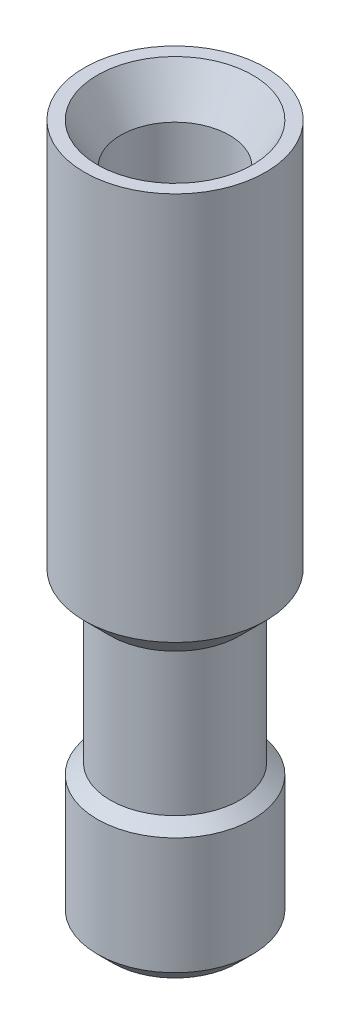
ISO-10303-21;
HEADER;
FILE_DESCRIPTION(('STEP AP214'),'2;1');
FILE_NAME('part.step','',(''),(''),'','','');
FILE_SCHEMA(('AUTOMOTIVE_DESIGN { 1 0 10303 214 1 1 1 1 }'));
ENDSEC;
DATA;
#1=APPLICATION_CONTEXT('core data for automotive mechanical design processes');
#2=APPLICATION_PROTOCOL_DEFINITION('international standard','automotive_design',2000,#1);
#3=PRODUCT_CONTEXT('',#1,'mechanical');
#4=PRODUCT('Part','Part','',(#3));
#5=PRODUCT_RELATED_PRODUCT_CATEGORY('part','',(#4));
#6=PRODUCT_DEFINITION_FORMATION('','',#4);
#7=PRODUCT_DEFINITION_CONTEXT('part definition',#1,'design');
#8=PRODUCT_DEFINITION('design','',#6,#7);
#9=PRODUCT_DEFINITION_SHAPE('','',#8);
#10=(LENGTH_UNIT() NAMED_UNIT(*) SI_UNIT(.MILLI.,.METRE.));
#11=(NAMED_UNIT(*) PLANE_ANGLE_UNIT() SI_UNIT($,.RADIAN.));
#12=(NAMED_UNIT(*) SI_UNIT($,.STERADIAN.) SOLID_ANGLE_UNIT());
#13=UNCERTAINTY_MEASURE_WITH_UNIT(LENGTH_MEASURE(1.E-05),#10,'distance_accuracy_value','');
#14=(GEOMETRIC_REPRESENTATION_CONTEXT(3) GLOBAL_UNCERTAINTY_ASSIGNED_CONTEXT((#13)) GLOBAL_UNIT_ASSIGNED_CONTEXT((#10,
#11,#12)) REPRESENTATION_CONTEXT('',''));
#15=CARTESIAN_POINT('',(0.,0.,0.));
#16=DIRECTION('',(0.,0.,1.));
#17=DIRECTION('',(1.,0.,0.));
#18=AXIS2_PLACEMENT_3D('',#15,#16,#17);
#19=CARTESIAN_POINT('',(-2.4,-13.5,0.));
#20=DIRECTION('',(0.,-1.,0.));
#21=DIRECTION('',(0.,0.,-1.));
#22=AXIS2_PLACEMENT_3D('',#19,#20,#21);
#23=PLANE('',#22);
#24=CARTESIAN_POINT('',(0.,-13.5,0.));
#25=DIRECTION('',(0.,1.,0.));
#26=DIRECTION('',(0.,0.,1.));
#27=AXIS2_PLACEMENT_3D('',#24,#25,#26);
#28=CIRCLE('',#27,2.1);
#29=CARTESIAN_POINT('',(0.,-13.5,2.1));
#30=VERTEX_POINT('',#29);
#31=EDGE_CURVE('E10',#30,#30,#28,.T.);
#32=ORIENTED_EDGE('',*,*,#31,.T.);
#33=EDGE_LOOP('',(#32));
#34=FACE_BOUND('',#33,.T.);
#35=CARTESIAN_POINT('',(0.,-13.5,0.));
#36=DIRECTION('',(0.,1.,0.));
#37=DIRECTION('',(0.,0.,1.));
#38=AXIS2_PLACEMENT_3D('',#35,#36,#37);
#39=CIRCLE('',#38,2.4);
#40=CARTESIAN_POINT('',(0.,-13.5,2.4));
#41=VERTEX_POINT('',#40);
#42=EDGE_CURVE('E49',#41,#41,#39,.T.);
#43=ORIENTED_EDGE('',*,*,#42,.F.);
#44=EDGE_LOOP('',(#43));
#45=FACE_BOUND('',#44,.T.);
#46=ADVANCED_FACE('F15',(#34,#45),#23,.T.);
#47=CARTESIAN_POINT('',(0.,13.5,0.));
#48=DIRECTION('',(0.,1.,0.));
#49=DIRECTION('',(0.,0.,1.));
#50=AXIS2_PLACEMENT_3D('',#47,#48,#49);
#51=CYLINDRICAL_SURFACE('',#50,2.1);
#52=CARTESIAN_POINT('',(0.,11.941154273188,0.));
#53=DIRECTION('',(0.,1.,0.));
#54=DIRECTION('',(0.,0.,1.));
#55=AXIS2_PLACEMENT_3D('',#52,#53,#54);
#56=CIRCLE('',#55,2.1);
#57=CARTESIAN_POINT('',(0.,11.941154273188,2.1));
#58=VERTEX_POINT('',#57);
#59=EDGE_CURVE('E21',#58,#58,#56,.T.);
#60=ORIENTED_EDGE('',*,*,#59,.T.);
#61=EDGE_LOOP('',(#60));
#62=FACE_BOUND('',#61,.T.);
#63=ORIENTED_EDGE('',*,*,#31,.F.);
#64=EDGE_LOOP('',(#63));
#65=FACE_BOUND('',#64,.T.);
#66=ADVANCED_FACE('F57',(#62,#65),#51,.F.);
#67=CARTESIAN_POINT('',(0.,11.941154273188,0.));
#68=DIRECTION('',(0.,1.,0.));
#69=DIRECTION('',(0.,0.,1.));
#70=AXIS2_PLACEMENT_3D('',#67,#68,#69);
#71=CONICAL_SURFACE('',#70,2.1,0.523598775598297);
#72=CARTESIAN_POINT('',(0.,13.5,0.));
#73=DIRECTION('',(0.,1.,0.));
#74=DIRECTION('',(0.,0.,1.));
#75=AXIS2_PLACEMENT_3D('',#72,#73,#74);
#76=CIRCLE('',#75,3.);
#77=CARTESIAN_POINT('',(0.,13.5,3.));
#78=VERTEX_POINT('',#77);
#79=EDGE_CURVE('E25',#78,#78,#76,.T.);
#80=ORIENTED_EDGE('',*,*,#79,.T.);
#81=EDGE_LOOP('',(#80));
#82=FACE_BOUND('',#81,.T.);
#83=ORIENTED_EDGE('',*,*,#59,.F.);
#84=EDGE_LOOP('',(#83));
#85=FACE_BOUND('',#84,.T.);
#86=ADVANCED_FACE('F63',(#82,#85),#71,.F.);
#87=CARTESIAN_POINT('',(-3.,13.5,0.));
#88=DIRECTION('',(0.,1.,0.));
#89=DIRECTION('',(0.,0.,1.));
#90=AXIS2_PLACEMENT_3D('',#87,#88,#89);
#91=PLANE('',#90);
#92=CARTESIAN_POINT('',(0.,13.5,0.));
#93=DIRECTION('',(0.,1.,0.));
#94=DIRECTION('',(0.,0.,1.));
#95=AXIS2_PLACEMENT_3D('',#92,#93,#94);
#96=CIRCLE('',#95,3.5);
#97=CARTESIAN_POINT('',(0.,13.5,3.5));
#98=VERTEX_POINT('',#97);
#99=EDGE_CURVE('E29',#98,#98,#96,.T.);
#100=ORIENTED_EDGE('',*,*,#99,.T.);
#101=EDGE_LOOP('',(#100));
#102=FACE_BOUND('',#101,.T.);
#103=ORIENTED_EDGE('',*,*,#79,.F.);
#104=EDGE_LOOP('',(#103));
#105=FACE_BOUND('',#104,.T.);
#106=ADVANCED_FACE('F68',(#102,#105),#91,.T.);
#107=CARTESIAN_POINT('',(0.,13.5,0.));
#108=DIRECTION('',(0.,1.,0.));
#109=DIRECTION('',(0.,0.,1.));
#110=AXIS2_PLACEMENT_3D('',#107,#108,#109);
#111=CYLINDRICAL_SURFACE('',#110,3.5);
#112=CARTESIAN_POINT('',(0.,-1.5,0.));
#113=DIRECTION('',(0.,1.,0.));
#114=DIRECTION('',(0.,0.,1.));
#115=AXIS2_PLACEMENT_3D('',#112,#113,#114);
#116=CIRCLE('',#115,3.5);
#117=CARTESIAN_POINT('',(0.,-1.5,3.5));
#118=VERTEX_POINT('',#117);
#119=EDGE_CURVE('E34',#118,#118,#116,.T.);
#120=ORIENTED_EDGE('',*,*,#119,.T.);
#121=EDGE_LOOP('',(#120));
#122=FACE_BOUND('',#121,.T.);
#123=ORIENTED_EDGE('',*,*,#99,.F.);
#124=EDGE_LOOP('',(#123));
#125=FACE_BOUND('',#124,.T.);
#126=ADVANCED_FACE('F75',(#122,#125),#111,.T.);
#127=CARTESIAN_POINT('',(0.,-1.5,0.));
#128=DIRECTION('',(0.,1.,0.));
#129=DIRECTION('',(0.,0.,1.));
#130=AXIS2_PLACEMENT_3D('',#127,#128,#129);
#131=CONICAL_SURFACE('',#130,3.5,0.78539816339745);
#132=CARTESIAN_POINT('',(0.,-2.5,0.));
#133=DIRECTION('',(0.,1.,0.));
#134=DIRECTION('',(0.,0.,1.));
#135=AXIS2_PLACEMENT_3D('',#132,#133,#134);
#136=CIRCLE('',#135,2.5);
#137=CARTESIAN_POINT('',(0.,-2.5,2.5));
#138=VERTEX_POINT('',#137);
#139=EDGE_CURVE('E37',#138,#138,#136,.T.);
#140=ORIENTED_EDGE('',*,*,#139,.T.);
#141=EDGE_LOOP('',(#140));
#142=FACE_BOUND('',#141,.T.);
#143=ORIENTED_EDGE('',*,*,#119,.F.);
#144=EDGE_LOOP('',(#143));
#145=FACE_BOUND('',#144,.T.);
#146=ADVANCED_FACE('F79',(#142,#145),#131,.T.);
#147=CARTESIAN_POINT('',(0.,13.5,0.));
#148=DIRECTION('',(0.,1.,0.));
#149=DIRECTION('',(0.,0.,1.));
#150=AXIS2_PLACEMENT_3D('',#147,#148,#149);
#151=CYLINDRICAL_SURFACE('',#150,2.5);
#152=CARTESIAN_POINT('',(0.,-8.,0.));
#153=DIRECTION('',(0.,1.,0.));
#154=DIRECTION('',(0.,0.,1.));
#155=AXIS2_PLACEMENT_3D('',#152,#153,#154);
#156=CIRCLE('',#155,2.5);
#157=CARTESIAN_POINT('',(0.,-8.,2.5));
#158=VERTEX_POINT('',#157);
#159=EDGE_CURVE('E40',#158,#158,#156,.T.);
#160=ORIENTED_EDGE('',*,*,#159,.T.);
#161=EDGE_LOOP('',(#160));
#162=FACE_BOUND('',#161,.T.);
#163=ORIENTED_EDGE('',*,*,#139,.F.);
#164=EDGE_LOOP('',(#163));
#165=FACE_BOUND('',#164,.T.);
#166=ADVANCED_FACE('F83',(#162,#165),#151,.T.);
#167=CARTESIAN_POINT('',(0.,-8.,0.));
#168=DIRECTION('',(0.,-1.,0.));
#169=DIRECTION('',(0.,0.,-1.));
#170=AXIS2_PLACEMENT_3D('',#167,#168,#169);
#171=CONICAL_SURFACE('',#170,2.5,0.907571211037053);
#172=CARTESIAN_POINT('',(0.,-8.39064281325336,0.));
#173=DIRECTION('',(0.,1.,0.));
#174=DIRECTION('',(0.,0.,1.));
#175=AXIS2_PLACEMENT_3D('',#172,#173,#174);
#176=CIRCLE('',#175,3.);
#177=CARTESIAN_POINT('',(0.,-8.39064281325336,3.));
#178=VERTEX_POINT('',#177);
#179=EDGE_CURVE('E43',#178,#178,#176,.T.);
#180=ORIENTED_EDGE('',*,*,#179,.T.);
#181=EDGE_LOOP('',(#180));
#182=FACE_BOUND('',#181,.T.);
#183=ORIENTED_EDGE('',*,*,#159,.F.);
#184=EDGE_LOOP('',(#183));
#185=FACE_BOUND('',#184,.T.);
#186=ADVANCED_FACE('F87',(#182,#185),#171,.T.);
#187=CARTESIAN_POINT('',(0.,13.5,0.));
#188=DIRECTION('',(0.,1.,0.));
#189=DIRECTION('',(0.,0.,1.));
#190=AXIS2_PLACEMENT_3D('',#187,#188,#189);
#191=CYLINDRICAL_SURFACE('',#190,3.);
#192=CARTESIAN_POINT('',(0.,-12.9,0.));
#193=DIRECTION('',(0.,1.,0.));
#194=DIRECTION('',(0.,0.,1.));
#195=AXIS2_PLACEMENT_3D('',#192,#193,#194);
#196=CIRCLE('',#195,3.);
#197=CARTESIAN_POINT('',(0.,-12.9,3.));
#198=VERTEX_POINT('',#197);
#199=EDGE_CURVE('E46',#198,#198,#196,.T.);
#200=ORIENTED_EDGE('',*,*,#199,.T.);
#201=EDGE_LOOP('',(#200));
#202=FACE_BOUND('',#201,.T.);
#203=ORIENTED_EDGE('',*,*,#179,.F.);
#204=EDGE_LOOP('',(#203));
#205=FACE_BOUND('',#204,.T.);
#206=ADVANCED_FACE('F91',(#202,#205),#191,.T.);
#207=CARTESIAN_POINT('',(0.,-12.9,0.));
#208=DIRECTION('',(0.,1.,0.));
#209=DIRECTION('',(0.,0.,1.));
#210=AXIS2_PLACEMENT_3D('',#207,#208,#209);
#211=CONICAL_SURFACE('',#210,3.,0.785398163397443);
#212=ORIENTED_EDGE('',*,*,#42,.T.);
#213=EDGE_LOOP('',(#212));
#214=FACE_BOUND('',#213,.T.);
#215=ORIENTED_EDGE('',*,*,#199,.F.);
#216=EDGE_LOOP('',(#215));
#217=FACE_BOUND('',#216,.T.);
#218=ADVANCED_FACE('F53',(#214,#217),#211,.T.);
#219=CLOSED_SHELL('',(#46,#66,#86,#106,#126,#146,#166,#186,#206,#218));
#220=MANIFOLD_SOLID_BREP('B1',#219);
#221=ADVANCED_BREP_SHAPE_REPRESENTATION('',(#18,#220),#14);
#222=SHAPE_DEFINITION_REPRESENTATION(#9,#221);
ENDSEC;
END-ISO-10303-21;
